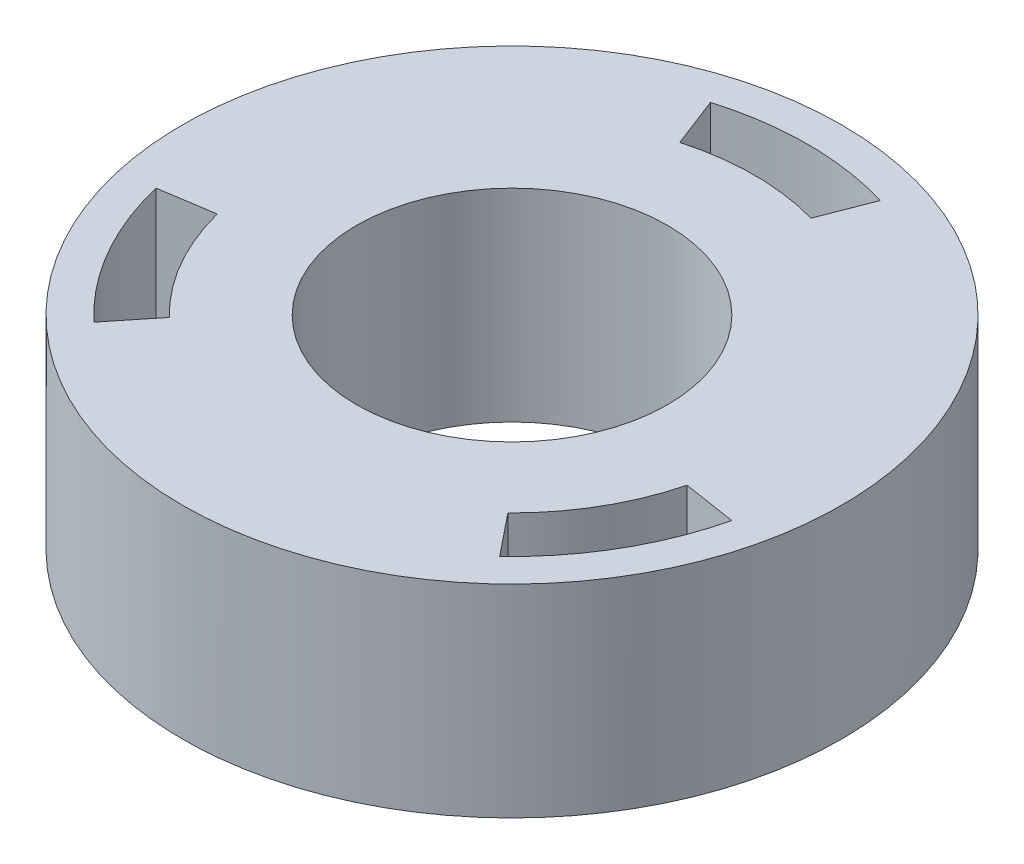
ISO-10303-21;
HEADER;
FILE_DESCRIPTION(('STEP AP214'),'2;1');
FILE_NAME('part.step','',(''),(''),'','','');
FILE_SCHEMA(('AUTOMOTIVE_DESIGN { 1 0 10303 214 1 1 1 1 }'));
ENDSEC;
DATA;
#1=APPLICATION_CONTEXT('core data for automotive mechanical design processes');
#2=APPLICATION_PROTOCOL_DEFINITION('international standard','automotive_design',2000,#1);
#3=PRODUCT_CONTEXT('',#1,'mechanical');
#4=PRODUCT('Part','Part','',(#3));
#5=PRODUCT_RELATED_PRODUCT_CATEGORY('part','',(#4));
#6=PRODUCT_DEFINITION_FORMATION('','',#4);
#7=PRODUCT_DEFINITION_CONTEXT('part definition',#1,'design');
#8=PRODUCT_DEFINITION('design','',#6,#7);
#9=PRODUCT_DEFINITION_SHAPE('','',#8);
#10=(LENGTH_UNIT() NAMED_UNIT(*) SI_UNIT(.MILLI.,.METRE.));
#11=(NAMED_UNIT(*) PLANE_ANGLE_UNIT() SI_UNIT($,.RADIAN.));
#12=(NAMED_UNIT(*) SI_UNIT($,.STERADIAN.) SOLID_ANGLE_UNIT());
#13=UNCERTAINTY_MEASURE_WITH_UNIT(LENGTH_MEASURE(1.E-05),#10,'distance_accuracy_value','');
#14=(GEOMETRIC_REPRESENTATION_CONTEXT(3) GLOBAL_UNCERTAINTY_ASSIGNED_CONTEXT((#13)) GLOBAL_UNIT_ASSIGNED_CONTEXT((#10,
#11,#12)) REPRESENTATION_CONTEXT('',''));
#15=CARTESIAN_POINT('',(0.,0.,0.));
#16=DIRECTION('',(0.,0.,1.));
#17=DIRECTION('',(1.,0.,0.));
#18=AXIS2_PLACEMENT_3D('',#15,#16,#17);
#19=CARTESIAN_POINT('',(-1.27447495769465,10.001,-0.493301449579187));
#20=DIRECTION('',(-0.932578861767965,0.,-0.36096629563377));
#21=DIRECTION('',(-0.36096629563377,0.,0.932578861767965));
#22=AXIS2_PLACEMENT_3D('',#19,#20,#21);
#23=PLANE('',#22);
#24=DIRECTION('',(0.36096629563377,0.,-0.932578861767965));
#25=VECTOR('',#24,1.);
#26=CARTESIAN_POINT('',(-1.27447495769465,10.,-0.493301449579187));
#27=LINE('',#26,#25);
#28=CARTESIAN_POINT('',(3.88547438094952,10.,-13.824351298885));
#29=VERTEX_POINT('',#28);
#30=CARTESIAN_POINT('',(5.03133336034405,10.,-16.7847491966284));
#31=VERTEX_POINT('',#30);
#32=EDGE_CURVE('E56',#29,#31,#27,.T.);
#33=ORIENTED_EDGE('',*,*,#32,.T.);
#34=DIRECTION('',(0.,-1.,0.));
#35=VECTOR('',#34,1.);
#36=CARTESIAN_POINT('',(5.03133336034404,65.218300634894,-16.7847491966284));
#37=LINE('',#36,#35);
#38=CARTESIAN_POINT('',(5.03133336034404,0.,-16.7847491966284));
#39=VERTEX_POINT('',#38);
#40=EDGE_CURVE('E170',#31,#39,#37,.T.);
#41=ORIENTED_EDGE('',*,*,#40,.T.);
#42=DIRECTION('',(0.36096629563377,0.,-0.932578861767965));
#43=VECTOR('',#42,1.);
#44=CARTESIAN_POINT('',(-1.27447495769465,0.,-0.493301449579187));
#45=LINE('',#44,#43);
#46=CARTESIAN_POINT('',(3.88547438094976,0.,-13.8243512988859));
#47=VERTEX_POINT('',#46);
#48=EDGE_CURVE('E226',#47,#39,#45,.T.);
#49=ORIENTED_EDGE('',*,*,#48,.F.);
#50=DIRECTION('',(0.,-1.,0.));
#51=VECTOR('',#50,1.);
#52=CARTESIAN_POINT('',(3.88547438094976,10.001,-13.8243512988859));
#53=LINE('',#52,#51);
#54=EDGE_CURVE('E230',#29,#47,#53,.T.);
#55=ORIENTED_EDGE('',*,*,#54,.F.);
#56=EDGE_LOOP('',(#33,#41,#49,#55));
#57=FACE_BOUND('',#56,.T.);
#58=ADVANCED_FACE('F41',(#57),#23,.T.);
#59=CARTESIAN_POINT('',(1.27447495769591,10.001,-0.493301449579669));
#60=DIRECTION('',(-0.932578861767966,0.,0.360966295633769));
#61=DIRECTION('',(0.360966295633769,0.,0.932578861767966));
#62=AXIS2_PLACEMENT_3D('',#59,#60,#61);
#63=PLANE('',#62);
#64=DIRECTION('',(0.,-1.,0.));
#65=VECTOR('',#64,1.);
#66=CARTESIAN_POINT('',(-5.03133336034273,65.218300634894,-16.7847491966288));
#67=LINE('',#66,#65);
#68=CARTESIAN_POINT('',(-5.03133336034273,10.,-16.7847491966288));
#69=VERTEX_POINT('',#68);
#70=CARTESIAN_POINT('',(-5.03133336034273,0.,-16.7847491966288));
#71=VERTEX_POINT('',#70);
#72=EDGE_CURVE('E64',#69,#71,#67,.T.);
#73=ORIENTED_EDGE('',*,*,#72,.F.);
#74=DIRECTION('',(-0.360966295633769,0.,-0.932578861767966));
#75=VECTOR('',#74,1.);
#76=CARTESIAN_POINT('',(1.27447495769591,10.,-0.493301449579669));
#77=LINE('',#76,#75);
#78=CARTESIAN_POINT('',(-3.88547438094831,10.,-13.8243512988859));
#79=VERTEX_POINT('',#78);
#80=EDGE_CURVE('E201',#79,#69,#77,.T.);
#81=ORIENTED_EDGE('',*,*,#80,.F.);
#82=DIRECTION('',(0.,-1.,0.));
#83=VECTOR('',#82,1.);
#84=CARTESIAN_POINT('',(-3.88547438094831,10.001,-13.8243512988859));
#85=LINE('',#84,#83);
#86=CARTESIAN_POINT('',(-3.88547438094831,0.,-13.8243512988859));
#87=VERTEX_POINT('',#86);
#88=EDGE_CURVE('E229',#79,#87,#85,.T.);
#89=ORIENTED_EDGE('',*,*,#88,.T.);
#90=DIRECTION('',(-0.360966295633769,0.,-0.932578861767966));
#91=VECTOR('',#90,1.);
#92=CARTESIAN_POINT('',(1.27447495769591,0.,-0.493301449579669));
#93=LINE('',#92,#91);
#94=EDGE_CURVE('E224',#87,#71,#93,.T.);
#95=ORIENTED_EDGE('',*,*,#94,.T.);
#96=EDGE_LOOP('',(#73,#81,#89,#95));
#97=FACE_BOUND('',#96,.T.);
#98=ADVANCED_FACE('F274',(#97),#63,.F.);
#99=CARTESIAN_POINT('',(0.210025891787967,10.001,1.35037841463965));
#100=DIRECTION('',(0.153683448955173,0.,0.98812013314032));
#101=DIRECTION('',(0.988120133140319,0.,-0.153683448955173));
#102=AXIS2_PLACEMENT_3D('',#99,#100,#101);
#103=PLANE('',#102);
#104=DIRECTION('',(-0.988120133140319,0.,0.153683448955173));
#105=VECTOR('',#104,1.);
#106=CARTESIAN_POINT('',(0.210025891787967,10.,1.35037841463965));
#107=LINE('',#106,#105);
#108=CARTESIAN_POINT('',(-13.9149766061497,10.,3.54725612978609));
#109=VERTEX_POINT('',#108);
#110=CARTESIAN_POINT('',(-17.0516858806028,10.,4.03511209334753));
#111=VERTEX_POINT('',#110);
#112=EDGE_CURVE('E200',#109,#111,#107,.T.);
#113=ORIENTED_EDGE('',*,*,#112,.T.);
#114=DIRECTION('',(0.,-1.,0.));
#115=VECTOR('',#114,1.);
#116=CARTESIAN_POINT('',(-17.0516858806028,65.218300634894,4.03511209334753));
#117=LINE('',#116,#115);
#118=CARTESIAN_POINT('',(-17.0516858806028,0.,4.03511209334753));
#119=VERTEX_POINT('',#118);
#120=EDGE_CURVE('E178',#111,#119,#117,.T.);
#121=ORIENTED_EDGE('',*,*,#120,.T.);
#122=DIRECTION('',(-0.98812013314032,0.,0.153683448955173));
#123=VECTOR('',#122,1.);
#124=CARTESIAN_POINT('',(0.210025891787967,0.,1.35037841463965));
#125=LINE('',#124,#123);
#126=CARTESIAN_POINT('',(-13.9149766061498,0.,3.54725612978609));
#127=VERTEX_POINT('',#126);
#128=EDGE_CURVE('E209',#127,#119,#125,.T.);
#129=ORIENTED_EDGE('',*,*,#128,.F.);
#130=DIRECTION('',(0.,-1.,0.));
#131=VECTOR('',#130,1.);
#132=CARTESIAN_POINT('',(-13.9149766061498,10.001,3.54725612978609));
#133=LINE('',#132,#131);
#134=EDGE_CURVE('E213',#109,#127,#133,.T.);
#135=ORIENTED_EDGE('',*,*,#134,.F.);
#136=EDGE_LOOP('',(#113,#121,#129,#135));
#137=FACE_BOUND('',#136,.T.);
#138=ADVANCED_FACE('F279',(#137),#103,.T.);
#139=CARTESIAN_POINT('',(-1.06444906590756,10.001,-0.85707696506186));
#140=DIRECTION('',(0.778895412812791,0.,0.627153837506551));
#141=DIRECTION('',(0.627153837506551,0.,-0.778895412812791));
#142=AXIS2_PLACEMENT_3D('',#139,#140,#141);
#143=PLANE('',#142);
#144=DIRECTION('',(0.,-1.,0.));
#145=VECTOR('',#144,1.);
#146=CARTESIAN_POINT('',(-12.0203525202596,65.218300634894,12.7496371032794));
#147=LINE('',#146,#145);
#148=CARTESIAN_POINT('',(-12.0203525202596,10.,12.7496371032794));
#149=VERTEX_POINT('',#148);
#150=CARTESIAN_POINT('',(-12.0203525202596,0.,12.7496371032794));
#151=VERTEX_POINT('',#150);
#152=EDGE_CURVE('E175',#149,#151,#147,.T.);
#153=ORIENTED_EDGE('',*,*,#152,.F.);
#154=DIRECTION('',(-0.627153837506551,0.,0.778895412812791));
#155=VECTOR('',#154,1.);
#156=CARTESIAN_POINT('',(-1.06444906590756,10.,-0.85707696506186));
#157=LINE('',#156,#155);
#158=CARTESIAN_POINT('',(-10.0295022252007,10.,10.2770951690971));
#159=VERTEX_POINT('',#158);
#160=EDGE_CURVE('E189',#159,#149,#157,.T.);
#161=ORIENTED_EDGE('',*,*,#160,.F.);
#162=DIRECTION('',(0.,-1.,0.));
#163=VECTOR('',#162,1.);
#164=CARTESIAN_POINT('',(-10.0295022252007,10.001,10.2770951690971));
#165=LINE('',#164,#163);
#166=CARTESIAN_POINT('',(-10.0295022252007,0.,10.2770951690971));
#167=VERTEX_POINT('',#166);
#168=EDGE_CURVE('E212',#159,#167,#165,.T.);
#169=ORIENTED_EDGE('',*,*,#168,.T.);
#170=DIRECTION('',(-0.627153837506551,0.,0.778895412812791));
#171=VECTOR('',#170,1.);
#172=CARTESIAN_POINT('',(-1.06444906590756,0.,-0.85707696506186));
#173=LINE('',#172,#171);
#174=EDGE_CURVE('E206',#167,#151,#173,.T.);
#175=ORIENTED_EDGE('',*,*,#174,.T.);
#176=EDGE_LOOP('',(#153,#161,#169,#175));
#177=FACE_BOUND('',#176,.T.);
#178=ADVANCED_FACE('F305',(#177),#143,.F.);
#179=CARTESIAN_POINT('',(1.06444906590691,10.001,-0.85707696506133));
#180=DIRECTION('',(0.778895412812792,0.,-0.627153837506549));
#181=DIRECTION('',(-0.627153837506549,0.,-0.778895412812792));
#182=AXIS2_PLACEMENT_3D('',#179,#180,#181);
#183=PLANE('',#182);
#184=DIRECTION('',(0.627153837506549,0.,0.778895412812792));
#185=VECTOR('',#184,1.);
#186=CARTESIAN_POINT('',(1.06444906590691,10.,-0.85707696506133));
#187=LINE('',#186,#185);
#188=CARTESIAN_POINT('',(10.0295022252004,10.,10.2770951690981));
#189=VERTEX_POINT('',#188);
#190=CARTESIAN_POINT('',(12.0203525202589,10.,12.74963710328));
#191=VERTEX_POINT('',#190);
#192=EDGE_CURVE('E147',#189,#191,#187,.T.);
#193=ORIENTED_EDGE('',*,*,#192,.T.);
#194=DIRECTION('',(0.,-1.,0.));
#195=VECTOR('',#194,1.);
#196=CARTESIAN_POINT('',(12.0203525202589,65.218300634894,12.74963710328));
#197=LINE('',#196,#195);
#198=CARTESIAN_POINT('',(12.0203525202589,0.,12.74963710328));
#199=VERTEX_POINT('',#198);
#200=EDGE_CURVE('E144',#191,#199,#197,.T.);
#201=ORIENTED_EDGE('',*,*,#200,.T.);
#202=DIRECTION('',(0.627153837506549,0.,0.778895412812792));
#203=VECTOR('',#202,1.);
#204=CARTESIAN_POINT('',(1.06444906590691,0.,-0.85707696506133));
#205=LINE('',#204,#203);
#206=CARTESIAN_POINT('',(10.0295022252004,0.,10.2770951690981));
#207=VERTEX_POINT('',#206);
#208=EDGE_CURVE('E131',#207,#199,#205,.T.);
#209=ORIENTED_EDGE('',*,*,#208,.F.);
#210=DIRECTION('',(0.,-1.,0.));
#211=VECTOR('',#210,1.);
#212=CARTESIAN_POINT('',(10.0295022252004,10.001,10.2770951690981));
#213=LINE('',#212,#211);
#214=EDGE_CURVE('E193',#189,#207,#213,.T.);
#215=ORIENTED_EDGE('',*,*,#214,.F.);
#216=EDGE_LOOP('',(#193,#201,#209,#215));
#217=FACE_BOUND('',#216,.T.);
#218=ADVANCED_FACE('F145',(#217),#183,.T.);
#219=CARTESIAN_POINT('',(-0.210025891788126,10.001,1.35037841464066));
#220=DIRECTION('',(0.153683448955175,0.,-0.988120133140319));
#221=DIRECTION('',(-0.988120133140319,0.,-0.153683448955175));
#222=AXIS2_PLACEMENT_3D('',#219,#220,#221);
#223=PLANE('',#222);
#224=DIRECTION('',(0.,-1.,0.));
#225=VECTOR('',#224,1.);
#226=CARTESIAN_POINT('',(17.0516858806026,65.218300634894,4.03511209334856));
#227=LINE('',#226,#225);
#228=CARTESIAN_POINT('',(17.0516858806026,10.,4.03511209334856));
#229=VERTEX_POINT('',#228);
#230=CARTESIAN_POINT('',(17.0516858806026,0.,4.03511209334856));
#231=VERTEX_POINT('',#230);
#232=EDGE_CURVE('E152',#229,#231,#227,.T.);
#233=ORIENTED_EDGE('',*,*,#232,.F.);
#234=DIRECTION('',(0.988120133140319,0.,0.153683448955175));
#235=VECTOR('',#234,1.);
#236=CARTESIAN_POINT('',(-0.210025891788126,10.,1.35037841464066));
#237=LINE('',#236,#235);
#238=CARTESIAN_POINT('',(13.9149766061495,10.,3.54725612978711));
#239=VERTEX_POINT('',#238);
#240=EDGE_CURVE('E49',#239,#229,#237,.T.);
#241=ORIENTED_EDGE('',*,*,#240,.F.);
#242=DIRECTION('',(0.,-1.,0.));
#243=VECTOR('',#242,1.);
#244=CARTESIAN_POINT('',(13.9149766061495,10.001,3.54725612978711));
#245=LINE('',#244,#243);
#246=CARTESIAN_POINT('',(13.9149766061495,0.,3.54725612978711));
#247=VERTEX_POINT('',#246);
#248=EDGE_CURVE('E140',#239,#247,#245,.T.);
#249=ORIENTED_EDGE('',*,*,#248,.T.);
#250=DIRECTION('',(0.988120133140319,0.,0.153683448955175));
#251=VECTOR('',#250,1.);
#252=CARTESIAN_POINT('',(-0.210025891788126,0.,1.35037841464066));
#253=LINE('',#252,#251);
#254=EDGE_CURVE('E141',#247,#231,#253,.T.);
#255=ORIENTED_EDGE('',*,*,#254,.T.);
#256=EDGE_LOOP('',(#233,#241,#249,#255));
#257=FACE_BOUND('',#256,.T.);
#258=ADVANCED_FACE('F300',(#257),#223,.F.);
#259=CARTESIAN_POINT('',(0.,0.,0.));
#260=DIRECTION('',(0.,-1.,0.));
#261=DIRECTION('',(0.,0.,-1.));
#262=AXIS2_PLACEMENT_3D('',#259,#260,#261);
#263=PLANE('',#262);
#264=CARTESIAN_POINT('',(0.,0.,0.));
#265=DIRECTION('',(0.,-1.,0.));
#266=DIRECTION('',(0.,0.,-1.));
#267=AXIS2_PLACEMENT_3D('',#264,#265,#266);
#268=CIRCLE('',#267,17.5226174122655);
#269=EDGE_CURVE('E172',#151,#119,#268,.T.);
#270=ORIENTED_EDGE('',*,*,#269,.F.);
#271=ORIENTED_EDGE('',*,*,#174,.F.);
#272=CARTESIAN_POINT('',(0.,0.,0.));
#273=DIRECTION('',(0.,-1.,0.));
#274=DIRECTION('',(0.,0.,-1.));
#275=AXIS2_PLACEMENT_3D('',#272,#273,#274);
#276=CIRCLE('',#275,14.36);
#277=EDGE_CURVE('E203',#167,#127,#276,.T.);
#278=ORIENTED_EDGE('',*,*,#277,.T.);
#279=ORIENTED_EDGE('',*,*,#128,.T.);
#280=EDGE_LOOP('',(#270,#271,#278,#279));
#281=FACE_BOUND('',#280,.T.);
#282=ADVANCED_FACE('F295',(#281),#263,.F.);
#283=CARTESIAN_POINT('',(0.,0.,0.));
#284=DIRECTION('',(0.,-1.,0.));
#285=DIRECTION('',(0.,0.,-1.));
#286=AXIS2_PLACEMENT_3D('',#283,#284,#285);
#287=CIRCLE('',#286,17.5226174122655);
#288=EDGE_CURVE('E151',#71,#39,#287,.T.);
#289=ORIENTED_EDGE('',*,*,#288,.F.);
#290=ORIENTED_EDGE('',*,*,#94,.F.);
#291=CARTESIAN_POINT('',(0.,0.,0.));
#292=DIRECTION('',(0.,-1.,0.));
#293=DIRECTION('',(0.,0.,-1.));
#294=AXIS2_PLACEMENT_3D('',#291,#292,#293);
#295=CIRCLE('',#294,14.36);
#296=EDGE_CURVE('E221',#87,#47,#295,.T.);
#297=ORIENTED_EDGE('',*,*,#296,.T.);
#298=ORIENTED_EDGE('',*,*,#48,.T.);
#299=EDGE_LOOP('',(#289,#290,#297,#298));
#300=FACE_BOUND('',#299,.T.);
#301=ADVANCED_FACE('F293',(#300),#263,.F.);
#302=CARTESIAN_POINT('',(0.,0.,0.));
#303=DIRECTION('',(0.,-1.,0.));
#304=DIRECTION('',(0.,0.,-1.));
#305=AXIS2_PLACEMENT_3D('',#302,#303,#304);
#306=CIRCLE('',#305,17.5226174122655);
#307=EDGE_CURVE('E11',#231,#199,#306,.T.);
#308=ORIENTED_EDGE('',*,*,#307,.F.);
#309=ORIENTED_EDGE('',*,*,#254,.F.);
#310=CARTESIAN_POINT('',(0.,0.,0.));
#311=DIRECTION('',(0.,-1.,0.));
#312=DIRECTION('',(0.,0.,-1.));
#313=AXIS2_PLACEMENT_3D('',#310,#311,#312);
#314=CIRCLE('',#313,14.36);
#315=EDGE_CURVE('E136',#247,#207,#314,.T.);
#316=ORIENTED_EDGE('',*,*,#315,.T.);
#317=ORIENTED_EDGE('',*,*,#208,.T.);
#318=EDGE_LOOP('',(#308,#309,#316,#317));
#319=FACE_BOUND('',#318,.T.);
#320=ADVANCED_FACE('F133',(#319),#263,.F.);
#321=CARTESIAN_POINT('',(0.,10.,0.));
#322=DIRECTION('',(0.,1.,0.));
#323=DIRECTION('',(0.,0.,1.));
#324=AXIS2_PLACEMENT_3D('',#321,#322,#323);
#325=PLANE('',#324);
#326=CARTESIAN_POINT('',(0.,10.,0.));
#327=DIRECTION('',(0.,1.,0.));
#328=DIRECTION('',(0.,0.,1.));
#329=AXIS2_PLACEMENT_3D('',#326,#327,#328);
#330=CIRCLE('',#329,17.5226174122655);
#331=EDGE_CURVE('E162',#69,#31,#330,.F.);
#332=ORIENTED_EDGE('',*,*,#331,.T.);
#333=ORIENTED_EDGE('',*,*,#32,.F.);
#334=CARTESIAN_POINT('',(0.,10.,0.));
#335=DIRECTION('',(0.,1.,0.));
#336=DIRECTION('',(0.,0.,1.));
#337=AXIS2_PLACEMENT_3D('',#334,#335,#336);
#338=CIRCLE('',#337,14.36);
#339=EDGE_CURVE('E186',#79,#29,#338,.F.);
#340=ORIENTED_EDGE('',*,*,#339,.F.);
#341=ORIENTED_EDGE('',*,*,#80,.T.);
#342=EDGE_LOOP('',(#332,#333,#340,#341));
#343=FACE_BOUND('',#342,.T.);
#344=EDGE_CURVE('E159',#149,#111,#330,.F.);
#345=ORIENTED_EDGE('',*,*,#344,.T.);
#346=ORIENTED_EDGE('',*,*,#112,.F.);
#347=CARTESIAN_POINT('',(0.,10.,0.));
#348=DIRECTION('',(0.,1.,0.));
#349=DIRECTION('',(0.,0.,1.));
#350=AXIS2_PLACEMENT_3D('',#347,#348,#349);
#351=CIRCLE('',#350,14.36);
#352=EDGE_CURVE('E198',#159,#109,#351,.F.);
#353=ORIENTED_EDGE('',*,*,#352,.F.);
#354=ORIENTED_EDGE('',*,*,#160,.T.);
#355=EDGE_LOOP('',(#345,#346,#353,#354));
#356=FACE_BOUND('',#355,.T.);
#357=EDGE_CURVE('E156',#229,#191,#330,.F.);
#358=ORIENTED_EDGE('',*,*,#357,.T.);
#359=ORIENTED_EDGE('',*,*,#192,.F.);
#360=CARTESIAN_POINT('',(0.,10.,0.));
#361=DIRECTION('',(0.,1.,0.));
#362=DIRECTION('',(0.,0.,1.));
#363=AXIS2_PLACEMENT_3D('',#360,#361,#362);
#364=CIRCLE('',#363,14.36);
#365=EDGE_CURVE('E187',#239,#189,#364,.F.);
#366=ORIENTED_EDGE('',*,*,#365,.F.);
#367=ORIENTED_EDGE('',*,*,#240,.T.);
#368=EDGE_LOOP('',(#358,#359,#366,#367));
#369=FACE_BOUND('',#368,.T.);
#370=CARTESIAN_POINT('',(0.,10.,0.));
#371=DIRECTION('',(0.,1.,0.));
#372=DIRECTION('',(0.,0.,1.));
#373=AXIS2_PLACEMENT_3D('',#370,#371,#372);
#374=CIRCLE('',#373,19.5226174122655);
#375=CARTESIAN_POINT('',(0.,10.,19.5226174122655));
#376=VERTEX_POINT('',#375);
#377=EDGE_CURVE('E165',#376,#376,#374,.F.);
#378=ORIENTED_EDGE('',*,*,#377,.F.);
#379=EDGE_LOOP('',(#378));
#380=FACE_BOUND('',#379,.T.);
#381=CARTESIAN_POINT('',(0.,10.,0.));
#382=DIRECTION('',(0.,1.,0.));
#383=DIRECTION('',(0.,0.,1.));
#384=AXIS2_PLACEMENT_3D('',#381,#382,#383);
#385=CIRCLE('',#384,9.21);
#386=CARTESIAN_POINT('',(0.,10.,9.21));
#387=VERTEX_POINT('',#386);
#388=EDGE_CURVE('E183',#387,#387,#385,.F.);
#389=ORIENTED_EDGE('',*,*,#388,.T.);
#390=EDGE_LOOP('',(#389));
#391=FACE_BOUND('',#390,.T.);
#392=ADVANCED_FACE('F43',(#343,#356,#369,#380,#391),#325,.T.);
#393=CARTESIAN_POINT('',(0.,10.001,0.));
#394=DIRECTION('',(0.,-1.,0.));
#395=DIRECTION('',(0.,0.,-1.));
#396=AXIS2_PLACEMENT_3D('',#393,#394,#395);
#397=CYLINDRICAL_SURFACE('',#396,14.36);
#398=ORIENTED_EDGE('',*,*,#339,.T.);
#399=ORIENTED_EDGE('',*,*,#54,.T.);
#400=ORIENTED_EDGE('',*,*,#296,.F.);
#401=ORIENTED_EDGE('',*,*,#88,.F.);
#402=EDGE_LOOP('',(#398,#399,#400,#401));
#403=FACE_BOUND('',#402,.T.);
#404=ADVANCED_FACE('F253',(#403),#397,.T.);
#405=CARTESIAN_POINT('',(0.,10.001,0.));
#406=DIRECTION('',(0.,-1.,0.));
#407=DIRECTION('',(0.,0.,-1.));
#408=AXIS2_PLACEMENT_3D('',#405,#406,#407);
#409=CYLINDRICAL_SURFACE('',#408,14.36);
#410=ORIENTED_EDGE('',*,*,#352,.T.);
#411=ORIENTED_EDGE('',*,*,#134,.T.);
#412=ORIENTED_EDGE('',*,*,#277,.F.);
#413=ORIENTED_EDGE('',*,*,#168,.F.);
#414=EDGE_LOOP('',(#410,#411,#412,#413));
#415=FACE_BOUND('',#414,.T.);
#416=ADVANCED_FACE('F282',(#415),#409,.T.);
#417=CARTESIAN_POINT('',(0.,10.001,0.));
#418=DIRECTION('',(0.,-1.,0.));
#419=DIRECTION('',(0.,0.,-1.));
#420=AXIS2_PLACEMENT_3D('',#417,#418,#419);
#421=CYLINDRICAL_SURFACE('',#420,14.36);
#422=ORIENTED_EDGE('',*,*,#365,.T.);
#423=ORIENTED_EDGE('',*,*,#214,.T.);
#424=ORIENTED_EDGE('',*,*,#315,.F.);
#425=ORIENTED_EDGE('',*,*,#248,.F.);
#426=EDGE_LOOP('',(#422,#423,#424,#425));
#427=FACE_BOUND('',#426,.T.);
#428=ADVANCED_FACE('F260',(#427),#421,.T.);
#429=CARTESIAN_POINT('',(0.,10.001,0.));
#430=DIRECTION('',(0.,-1.,0.));
#431=DIRECTION('',(0.,0.,-1.));
#432=AXIS2_PLACEMENT_3D('',#429,#430,#431);
#433=CYLINDRICAL_SURFACE('',#432,9.21);
#434=ORIENTED_EDGE('',*,*,#388,.F.);
#435=EDGE_LOOP('',(#434));
#436=FACE_BOUND('',#435,.T.);
#437=CARTESIAN_POINT('',(0.,-2.,0.));
#438=DIRECTION('',(0.,-1.,0.));
#439=DIRECTION('',(0.,0.,-1.));
#440=AXIS2_PLACEMENT_3D('',#437,#438,#439);
#441=CIRCLE('',#440,9.21);
#442=CARTESIAN_POINT('',(0.,-2.,-9.21));
#443=VERTEX_POINT('',#442);
#444=EDGE_CURVE('E180',#443,#443,#441,.T.);
#445=ORIENTED_EDGE('',*,*,#444,.T.);
#446=EDGE_LOOP('',(#445));
#447=FACE_BOUND('',#446,.T.);
#448=ADVANCED_FACE('F256',(#436,#447),#433,.F.);
#449=CARTESIAN_POINT('',(0.,-2.,0.));
#450=DIRECTION('',(0.,-1.,0.));
#451=DIRECTION('',(0.,0.,-1.));
#452=AXIS2_PLACEMENT_3D('',#449,#450,#451);
#453=PLANE('',#452);
#454=ORIENTED_EDGE('',*,*,#444,.F.);
#455=EDGE_LOOP('',(#454));
#456=FACE_BOUND('',#455,.T.);
#457=CARTESIAN_POINT('',(0.,-2.,0.));
#458=DIRECTION('',(0.,-1.,0.));
#459=DIRECTION('',(0.,0.,-1.));
#460=AXIS2_PLACEMENT_3D('',#457,#458,#459);
#461=CIRCLE('',#460,19.5226174122655);
#462=CARTESIAN_POINT('',(0.,-2.,-19.5226174122655));
#463=VERTEX_POINT('',#462);
#464=EDGE_CURVE('E241',#463,#463,#461,.T.);
#465=ORIENTED_EDGE('',*,*,#464,.T.);
#466=EDGE_LOOP('',(#465));
#467=FACE_BOUND('',#466,.T.);
#468=ADVANCED_FACE('F259',(#456,#467),#453,.T.);
#469=CARTESIAN_POINT('',(0.,65.218300634894,0.));
#470=DIRECTION('',(0.,-1.,0.));
#471=DIRECTION('',(0.,0.,-1.));
#472=AXIS2_PLACEMENT_3D('',#469,#470,#471);
#473=CYLINDRICAL_SURFACE('',#472,17.5226174122655);
#474=ORIENTED_EDGE('',*,*,#120,.F.);
#475=ORIENTED_EDGE('',*,*,#344,.F.);
#476=ORIENTED_EDGE('',*,*,#152,.T.);
#477=ORIENTED_EDGE('',*,*,#269,.T.);
#478=EDGE_LOOP('',(#474,#475,#476,#477));
#479=FACE_BOUND('',#478,.T.);
#480=ADVANCED_FACE('F265',(#479),#473,.F.);
#481=ORIENTED_EDGE('',*,*,#40,.F.);
#482=ORIENTED_EDGE('',*,*,#331,.F.);
#483=ORIENTED_EDGE('',*,*,#72,.T.);
#484=ORIENTED_EDGE('',*,*,#288,.T.);
#485=EDGE_LOOP('',(#481,#482,#483,#484));
#486=FACE_BOUND('',#485,.T.);
#487=ADVANCED_FACE('F240',(#486),#473,.F.);
#488=CARTESIAN_POINT('',(0.,65.218300634894,0.));
#489=DIRECTION('',(0.,-1.,0.));
#490=DIRECTION('',(0.,0.,-1.));
#491=AXIS2_PLACEMENT_3D('',#488,#489,#490);
#492=CYLINDRICAL_SURFACE('',#491,19.5226174122655);
#493=ORIENTED_EDGE('',*,*,#464,.F.);
#494=EDGE_LOOP('',(#493));
#495=FACE_BOUND('',#494,.T.);
#496=ORIENTED_EDGE('',*,*,#377,.T.);
#497=EDGE_LOOP('',(#496));
#498=FACE_BOUND('',#497,.T.);
#499=ADVANCED_FACE('F249',(#495,#498),#492,.T.);
#500=ORIENTED_EDGE('',*,*,#200,.F.);
#501=ORIENTED_EDGE('',*,*,#357,.F.);
#502=ORIENTED_EDGE('',*,*,#232,.T.);
#503=ORIENTED_EDGE('',*,*,#307,.T.);
#504=EDGE_LOOP('',(#500,#501,#502,#503));
#505=FACE_BOUND('',#504,.T.);
#506=ADVANCED_FACE('F155',(#505),#473,.F.);
#507=CLOSED_SHELL('',(#58,#98,#138,#178,#218,#258,#282,#301,#320,#392,#404,#416,#428,#448,#468,
#480,#487,#499,#506));
#508=MANIFOLD_SOLID_BREP('B2',#507);
#509=ADVANCED_BREP_SHAPE_REPRESENTATION('',(#18,#508),#14);
#510=SHAPE_DEFINITION_REPRESENTATION(#9,#509);
ENDSEC;
END-ISO-10303-21;
